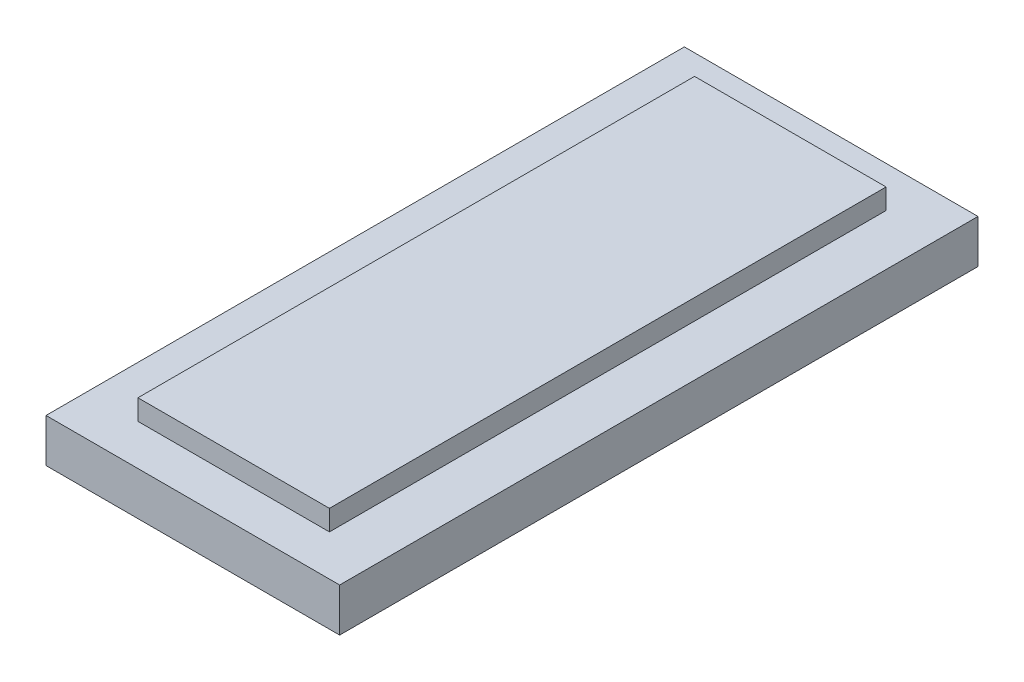
ISO-10303-21;
HEADER;
FILE_DESCRIPTION(('STEP AP214'),'2;1');
FILE_NAME('part.step','',(''),(''),'','','');
FILE_SCHEMA(('AUTOMOTIVE_DESIGN { 1 0 10303 214 1 1 1 1 }'));
ENDSEC;
DATA;
#1=APPLICATION_CONTEXT('core data for automotive mechanical design processes');
#2=APPLICATION_PROTOCOL_DEFINITION('international standard','automotive_design',2000,#1);
#3=PRODUCT_CONTEXT('',#1,'mechanical');
#4=PRODUCT('Part','Part','',(#3));
#5=PRODUCT_RELATED_PRODUCT_CATEGORY('part','',(#4));
#6=PRODUCT_DEFINITION_FORMATION('','',#4);
#7=PRODUCT_DEFINITION_CONTEXT('part definition',#1,'design');
#8=PRODUCT_DEFINITION('design','',#6,#7);
#9=PRODUCT_DEFINITION_SHAPE('','',#8);
#10=(LENGTH_UNIT() NAMED_UNIT(*) SI_UNIT(.MILLI.,.METRE.));
#11=(NAMED_UNIT(*) PLANE_ANGLE_UNIT() SI_UNIT($,.RADIAN.));
#12=(NAMED_UNIT(*) SI_UNIT($,.STERADIAN.) SOLID_ANGLE_UNIT());
#13=UNCERTAINTY_MEASURE_WITH_UNIT(LENGTH_MEASURE(1.E-05),#10,'distance_accuracy_value','');
#14=(GEOMETRIC_REPRESENTATION_CONTEXT(3) GLOBAL_UNCERTAINTY_ASSIGNED_CONTEXT((#13)) GLOBAL_UNIT_ASSIGNED_CONTEXT((#10,
#11,#12)) REPRESENTATION_CONTEXT('',''));
#15=CARTESIAN_POINT('',(0.,0.,0.));
#16=DIRECTION('',(0.,0.,1.));
#17=DIRECTION('',(1.,0.,0.));
#18=AXIS2_PLACEMENT_3D('',#15,#16,#17);
#19=CARTESIAN_POINT('',(0.,7.9375,0.));
#20=DIRECTION('',(1.,0.,0.));
#21=DIRECTION('',(0.,0.,-1.));
#22=AXIS2_PLACEMENT_3D('',#19,#20,#21);
#23=PLANE('',#22);
#24=DIRECTION('',(0.,0.,1.));
#25=VECTOR('',#24,1.);
#26=CARTESIAN_POINT('',(0.,5.3975,-79.375));
#27=LINE('',#26,#25);
#28=CARTESIAN_POINT('',(0.,5.3975,-79.375));
#29=VERTEX_POINT('',#28);
#30=CARTESIAN_POINT('',(0.,5.3975,0.));
#31=VERTEX_POINT('',#30);
#32=EDGE_CURVE('E158',#29,#31,#27,.T.);
#33=ORIENTED_EDGE('',*,*,#32,.F.);
#34=DIRECTION('',(0.,-1.,0.));
#35=VECTOR('',#34,1.);
#36=CARTESIAN_POINT('',(0.,7.9375,-79.375));
#37=LINE('',#36,#35);
#38=CARTESIAN_POINT('',(0.,0.,-79.375));
#39=VERTEX_POINT('',#38);
#40=EDGE_CURVE('E190',#29,#39,#37,.T.);
#41=ORIENTED_EDGE('',*,*,#40,.T.);
#42=DIRECTION('',(0.,0.,1.));
#43=VECTOR('',#42,1.);
#44=CARTESIAN_POINT('',(0.,0.,0.));
#45=LINE('',#44,#43);
#46=CARTESIAN_POINT('',(0.,0.,0.));
#47=VERTEX_POINT('',#46);
#48=EDGE_CURVE('E174',#39,#47,#45,.T.);
#49=ORIENTED_EDGE('',*,*,#48,.T.);
#50=DIRECTION('',(0.,-1.,0.));
#51=VECTOR('',#50,1.);
#52=CARTESIAN_POINT('',(0.,7.9375,0.));
#53=LINE('',#52,#51);
#54=EDGE_CURVE('E12',#31,#47,#53,.T.);
#55=ORIENTED_EDGE('',*,*,#54,.F.);
#56=EDGE_LOOP('',(#33,#41,#49,#55));
#57=FACE_BOUND('',#56,.T.);
#58=ADVANCED_FACE('F47',(#57),#23,.F.);
#59=CARTESIAN_POINT('',(0.,7.9375,0.));
#60=DIRECTION('',(0.,0.,-1.));
#61=DIRECTION('',(-1.,0.,0.));
#62=AXIS2_PLACEMENT_3D('',#59,#60,#61);
#63=PLANE('',#62);
#64=DIRECTION('',(1.,0.,0.));
#65=VECTOR('',#64,1.);
#66=CARTESIAN_POINT('',(0.,5.3975,0.));
#67=LINE('',#66,#65);
#68=CARTESIAN_POINT('',(36.5125,5.3975,0.));
#69=VERTEX_POINT('',#68);
#70=EDGE_CURVE('E166',#31,#69,#67,.T.);
#71=ORIENTED_EDGE('',*,*,#70,.F.);
#72=ORIENTED_EDGE('',*,*,#54,.T.);
#73=DIRECTION('',(1.,0.,0.));
#74=VECTOR('',#73,1.);
#75=CARTESIAN_POINT('',(0.,0.,0.));
#76=LINE('',#75,#74);
#77=CARTESIAN_POINT('',(36.5125,0.,0.));
#78=VERTEX_POINT('',#77);
#79=EDGE_CURVE('E178',#47,#78,#76,.T.);
#80=ORIENTED_EDGE('',*,*,#79,.T.);
#81=DIRECTION('',(0.,-1.,0.));
#82=VECTOR('',#81,1.);
#83=CARTESIAN_POINT('',(36.5125,7.9375,0.));
#84=LINE('',#83,#82);
#85=EDGE_CURVE('E55',#69,#78,#84,.T.);
#86=ORIENTED_EDGE('',*,*,#85,.F.);
#87=EDGE_LOOP('',(#71,#72,#80,#86));
#88=FACE_BOUND('',#87,.T.);
#89=ADVANCED_FACE('F205',(#88),#63,.F.);
#90=CARTESIAN_POINT('',(36.5125,7.9375,0.));
#91=DIRECTION('',(-1.,0.,0.));
#92=DIRECTION('',(0.,0.,1.));
#93=AXIS2_PLACEMENT_3D('',#90,#91,#92);
#94=PLANE('',#93);
#95=DIRECTION('',(0.,0.,-1.));
#96=VECTOR('',#95,1.);
#97=CARTESIAN_POINT('',(36.5125,5.3975,0.));
#98=LINE('',#97,#96);
#99=CARTESIAN_POINT('',(36.5125,5.3975,-79.375));
#100=VERTEX_POINT('',#99);
#101=EDGE_CURVE('E62',#69,#100,#98,.T.);
#102=ORIENTED_EDGE('',*,*,#101,.F.);
#103=ORIENTED_EDGE('',*,*,#85,.T.);
#104=DIRECTION('',(0.,0.,-1.));
#105=VECTOR('',#104,1.);
#106=CARTESIAN_POINT('',(36.5125,0.,0.));
#107=LINE('',#106,#105);
#108=CARTESIAN_POINT('',(36.5125,0.,-79.375));
#109=VERTEX_POINT('',#108);
#110=EDGE_CURVE('E182',#78,#109,#107,.T.);
#111=ORIENTED_EDGE('',*,*,#110,.T.);
#112=DIRECTION('',(0.,-1.,0.));
#113=VECTOR('',#112,1.);
#114=CARTESIAN_POINT('',(36.5125,7.9375,-79.375));
#115=LINE('',#114,#113);
#116=EDGE_CURVE('E193',#100,#109,#115,.T.);
#117=ORIENTED_EDGE('',*,*,#116,.F.);
#118=EDGE_LOOP('',(#102,#103,#111,#117));
#119=FACE_BOUND('',#118,.T.);
#120=ADVANCED_FACE('F198',(#119),#94,.F.);
#121=CARTESIAN_POINT('',(0.,7.9375,-79.375));
#122=DIRECTION('',(0.,0.,1.));
#123=DIRECTION('',(1.,0.,0.));
#124=AXIS2_PLACEMENT_3D('',#121,#122,#123);
#125=PLANE('',#124);
#126=DIRECTION('',(-1.,0.,0.));
#127=VECTOR('',#126,1.);
#128=CARTESIAN_POINT('',(36.5125,5.3975,-79.375));
#129=LINE('',#128,#127);
#130=EDGE_CURVE('E171',#100,#29,#129,.T.);
#131=ORIENTED_EDGE('',*,*,#130,.F.);
#132=ORIENTED_EDGE('',*,*,#116,.T.);
#133=DIRECTION('',(-1.,0.,0.));
#134=VECTOR('',#133,1.);
#135=CARTESIAN_POINT('',(0.,0.,-79.375));
#136=LINE('',#135,#134);
#137=EDGE_CURVE('E186',#109,#39,#136,.T.);
#138=ORIENTED_EDGE('',*,*,#137,.T.);
#139=ORIENTED_EDGE('',*,*,#40,.F.);
#140=EDGE_LOOP('',(#131,#132,#138,#139));
#141=FACE_BOUND('',#140,.T.);
#142=ADVANCED_FACE('F212',(#141),#125,.F.);
#143=CARTESIAN_POINT('',(0.,0.,0.));
#144=DIRECTION('',(0.,-1.,0.));
#145=DIRECTION('',(0.,0.,-1.));
#146=AXIS2_PLACEMENT_3D('',#143,#144,#145);
#147=PLANE('',#146);
#148=ORIENTED_EDGE('',*,*,#48,.F.);
#149=ORIENTED_EDGE('',*,*,#137,.F.);
#150=ORIENTED_EDGE('',*,*,#110,.F.);
#151=ORIENTED_EDGE('',*,*,#79,.F.);
#152=EDGE_LOOP('',(#148,#149,#150,#151));
#153=FACE_BOUND('',#152,.T.);
#154=ADVANCED_FACE('F209',(#153),#147,.T.);
#155=CARTESIAN_POINT('',(0.,5.3975,0.));
#156=DIRECTION('',(0.,1.,0.));
#157=DIRECTION('',(0.,0.,1.));
#158=AXIS2_PLACEMENT_3D('',#155,#156,#157);
#159=PLANE('',#158);
#160=DIRECTION('',(0.,0.,-1.));
#161=VECTOR('',#160,1.);
#162=CARTESIAN_POINT('',(30.1625,5.3975,-5.08));
#163=LINE('',#162,#161);
#164=CARTESIAN_POINT('',(30.1625,5.3975,-5.08));
#165=VERTEX_POINT('',#164);
#166=CARTESIAN_POINT('',(30.1625,5.3975,-74.295));
#167=VERTEX_POINT('',#166);
#168=EDGE_CURVE('E124',#165,#167,#163,.T.);
#169=ORIENTED_EDGE('',*,*,#168,.F.);
#170=DIRECTION('',(1.,0.,0.));
#171=VECTOR('',#170,1.);
#172=CARTESIAN_POINT('',(6.35,5.3975,-5.08));
#173=LINE('',#172,#171);
#174=CARTESIAN_POINT('',(6.35,5.3975,-5.08));
#175=VERTEX_POINT('',#174);
#176=EDGE_CURVE('E133',#175,#165,#173,.T.);
#177=ORIENTED_EDGE('',*,*,#176,.F.);
#178=DIRECTION('',(0.,0.,1.));
#179=VECTOR('',#178,1.);
#180=CARTESIAN_POINT('',(6.35,5.3975,-74.295));
#181=LINE('',#180,#179);
#182=CARTESIAN_POINT('',(6.35,5.3975,-74.295));
#183=VERTEX_POINT('',#182);
#184=EDGE_CURVE('E115',#183,#175,#181,.T.);
#185=ORIENTED_EDGE('',*,*,#184,.F.);
#186=DIRECTION('',(-1.,0.,0.));
#187=VECTOR('',#186,1.);
#188=CARTESIAN_POINT('',(30.1625,5.3975,-74.295));
#189=LINE('',#188,#187);
#190=EDGE_CURVE('E130',#167,#183,#189,.T.);
#191=ORIENTED_EDGE('',*,*,#190,.F.);
#192=EDGE_LOOP('',(#169,#177,#185,#191));
#193=FACE_BOUND('',#192,.T.);
#194=ORIENTED_EDGE('',*,*,#32,.T.);
#195=ORIENTED_EDGE('',*,*,#70,.T.);
#196=ORIENTED_EDGE('',*,*,#101,.T.);
#197=ORIENTED_EDGE('',*,*,#130,.T.);
#198=EDGE_LOOP('',(#194,#195,#196,#197));
#199=FACE_BOUND('',#198,.T.);
#200=ADVANCED_FACE('F129',(#193,#199),#159,.T.);
#201=CARTESIAN_POINT('',(30.1625,5.3975,-74.295));
#202=DIRECTION('',(0.,0.,-1.));
#203=DIRECTION('',(-1.,0.,0.));
#204=AXIS2_PLACEMENT_3D('',#201,#202,#203);
#205=PLANE('',#204);
#206=DIRECTION('',(-1.,0.,0.));
#207=VECTOR('',#206,1.);
#208=CARTESIAN_POINT('',(30.1625,7.9375,-74.295));
#209=LINE('',#208,#207);
#210=CARTESIAN_POINT('',(30.1625,7.9375,-74.295));
#211=VERTEX_POINT('',#210);
#212=CARTESIAN_POINT('',(6.35,7.9375,-74.295));
#213=VERTEX_POINT('',#212);
#214=EDGE_CURVE('E149',#211,#213,#209,.T.);
#215=ORIENTED_EDGE('',*,*,#214,.F.);
#216=DIRECTION('',(0.,1.,0.));
#217=VECTOR('',#216,1.);
#218=CARTESIAN_POINT('',(30.1625,5.3975,-74.295));
#219=LINE('',#218,#217);
#220=EDGE_CURVE('E137',#167,#211,#219,.T.);
#221=ORIENTED_EDGE('',*,*,#220,.F.);
#222=ORIENTED_EDGE('',*,*,#190,.T.);
#223=DIRECTION('',(0.,1.,0.));
#224=VECTOR('',#223,1.);
#225=CARTESIAN_POINT('',(6.35,5.3975,-74.295));
#226=LINE('',#225,#224);
#227=EDGE_CURVE('E112',#183,#213,#226,.T.);
#228=ORIENTED_EDGE('',*,*,#227,.T.);
#229=EDGE_LOOP('',(#215,#221,#222,#228));
#230=FACE_BOUND('',#229,.T.);
#231=ADVANCED_FACE('F136',(#230),#205,.T.);
#232=CARTESIAN_POINT('',(30.1625,5.3975,-5.08));
#233=DIRECTION('',(1.,0.,0.));
#234=DIRECTION('',(0.,0.,-1.));
#235=AXIS2_PLACEMENT_3D('',#232,#233,#234);
#236=PLANE('',#235);
#237=DIRECTION('',(0.,0.,-1.));
#238=VECTOR('',#237,1.);
#239=CARTESIAN_POINT('',(30.1625,7.9375,-5.08));
#240=LINE('',#239,#238);
#241=CARTESIAN_POINT('',(30.1625,7.9375,-5.08));
#242=VERTEX_POINT('',#241);
#243=EDGE_CURVE('E139',#242,#211,#240,.T.);
#244=ORIENTED_EDGE('',*,*,#243,.F.);
#245=DIRECTION('',(0.,1.,0.));
#246=VECTOR('',#245,1.);
#247=CARTESIAN_POINT('',(30.1625,5.3975,-5.08));
#248=LINE('',#247,#246);
#249=EDGE_CURVE('E159',#165,#242,#248,.T.);
#250=ORIENTED_EDGE('',*,*,#249,.F.);
#251=ORIENTED_EDGE('',*,*,#168,.T.);
#252=ORIENTED_EDGE('',*,*,#220,.T.);
#253=EDGE_LOOP('',(#244,#250,#251,#252));
#254=FACE_BOUND('',#253,.T.);
#255=ADVANCED_FACE('F237',(#254),#236,.T.);
#256=CARTESIAN_POINT('',(6.35,5.3975,-5.08));
#257=DIRECTION('',(0.,0.,1.));
#258=DIRECTION('',(1.,0.,0.));
#259=AXIS2_PLACEMENT_3D('',#256,#257,#258);
#260=PLANE('',#259);
#261=DIRECTION('',(1.,0.,0.));
#262=VECTOR('',#261,1.);
#263=CARTESIAN_POINT('',(6.35,7.9375,-5.08));
#264=LINE('',#263,#262);
#265=CARTESIAN_POINT('',(6.35,7.9375,-5.08));
#266=VERTEX_POINT('',#265);
#267=EDGE_CURVE('E70',#266,#242,#264,.T.);
#268=ORIENTED_EDGE('',*,*,#267,.F.);
#269=DIRECTION('',(0.,1.,0.));
#270=VECTOR('',#269,1.);
#271=CARTESIAN_POINT('',(6.35,5.3975,-5.08));
#272=LINE('',#271,#270);
#273=EDGE_CURVE('E123',#175,#266,#272,.T.);
#274=ORIENTED_EDGE('',*,*,#273,.F.);
#275=ORIENTED_EDGE('',*,*,#176,.T.);
#276=ORIENTED_EDGE('',*,*,#249,.T.);
#277=EDGE_LOOP('',(#268,#274,#275,#276));
#278=FACE_BOUND('',#277,.T.);
#279=ADVANCED_FACE('F240',(#278),#260,.T.);
#280=CARTESIAN_POINT('',(6.35,5.3975,-74.295));
#281=DIRECTION('',(-1.,0.,0.));
#282=DIRECTION('',(0.,0.,1.));
#283=AXIS2_PLACEMENT_3D('',#280,#281,#282);
#284=PLANE('',#283);
#285=DIRECTION('',(0.,0.,1.));
#286=VECTOR('',#285,1.);
#287=CARTESIAN_POINT('',(6.35,7.9375,-74.295));
#288=LINE('',#287,#286);
#289=EDGE_CURVE('E117',#213,#266,#288,.T.);
#290=ORIENTED_EDGE('',*,*,#289,.F.);
#291=ORIENTED_EDGE('',*,*,#227,.F.);
#292=ORIENTED_EDGE('',*,*,#184,.T.);
#293=ORIENTED_EDGE('',*,*,#273,.T.);
#294=EDGE_LOOP('',(#290,#291,#292,#293));
#295=FACE_BOUND('',#294,.T.);
#296=ADVANCED_FACE('F114',(#295),#284,.T.);
#297=CARTESIAN_POINT('',(0.,7.9375,0.));
#298=DIRECTION('',(0.,-1.,0.));
#299=DIRECTION('',(0.,0.,-1.));
#300=AXIS2_PLACEMENT_3D('',#297,#298,#299);
#301=PLANE('',#300);
#302=ORIENTED_EDGE('',*,*,#214,.T.);
#303=ORIENTED_EDGE('',*,*,#289,.T.);
#304=ORIENTED_EDGE('',*,*,#267,.T.);
#305=ORIENTED_EDGE('',*,*,#243,.T.);
#306=EDGE_LOOP('',(#302,#303,#304,#305));
#307=FACE_BOUND('',#306,.T.);
#308=ADVANCED_FACE('F229',(#307),#301,.F.);
#309=CLOSED_SHELL('',(#58,#89,#120,#142,#154,#200,#231,#255,#279,#296,#308));
#310=MANIFOLD_SOLID_BREP('B2',#309);
#311=ADVANCED_BREP_SHAPE_REPRESENTATION('',(#18,#310),#14);
#312=SHAPE_DEFINITION_REPRESENTATION(#9,#311);
ENDSEC;
END-ISO-10303-21;
